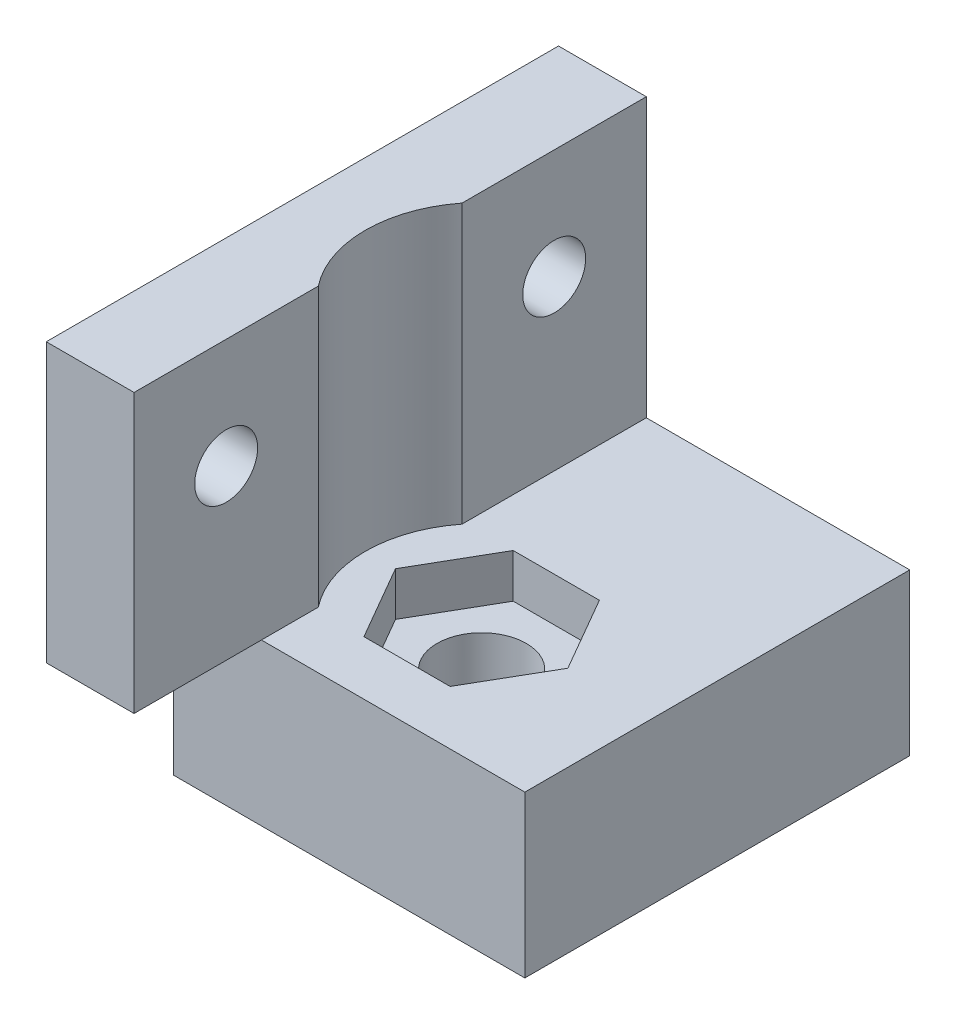
ISO-10303-21;
HEADER;
FILE_DESCRIPTION(('STEP AP214'),'2;1');
FILE_NAME('part.step','',(''),(''),'','','');
FILE_SCHEMA(('AUTOMOTIVE_DESIGN { 1 0 10303 214 1 1 1 1 }'));
ENDSEC;
DATA;
#1=APPLICATION_CONTEXT('core data for automotive mechanical design processes');
#2=APPLICATION_PROTOCOL_DEFINITION('international standard','automotive_design',2000,#1);
#3=PRODUCT_CONTEXT('',#1,'mechanical');
#4=PRODUCT('Part','Part','',(#3));
#5=PRODUCT_RELATED_PRODUCT_CATEGORY('part','',(#4));
#6=PRODUCT_DEFINITION_FORMATION('','',#4);
#7=PRODUCT_DEFINITION_CONTEXT('part definition',#1,'design');
#8=PRODUCT_DEFINITION('design','',#6,#7);
#9=PRODUCT_DEFINITION_SHAPE('','',#8);
#10=(LENGTH_UNIT() NAMED_UNIT(*) SI_UNIT(.MILLI.,.METRE.));
#11=(NAMED_UNIT(*) PLANE_ANGLE_UNIT() SI_UNIT($,.RADIAN.));
#12=(NAMED_UNIT(*) SI_UNIT($,.STERADIAN.) SOLID_ANGLE_UNIT());
#13=UNCERTAINTY_MEASURE_WITH_UNIT(LENGTH_MEASURE(1.E-05),#10,'distance_accuracy_value','');
#14=(GEOMETRIC_REPRESENTATION_CONTEXT(3) GLOBAL_UNCERTAINTY_ASSIGNED_CONTEXT((#13)) GLOBAL_UNIT_ASSIGNED_CONTEXT((#10,
#11,#12)) REPRESENTATION_CONTEXT('',''));
#15=CARTESIAN_POINT('',(0.,0.,0.));
#16=DIRECTION('',(0.,0.,1.));
#17=DIRECTION('',(1.,0.,0.));
#18=AXIS2_PLACEMENT_3D('',#15,#16,#17);
#19=CARTESIAN_POINT('',(0.,11.,17.5));
#20=DIRECTION('',(0.,0.,-1.));
#21=DIRECTION('',(-1.,0.,0.));
#22=AXIS2_PLACEMENT_3D('',#19,#20,#21);
#23=PLANE('',#22);
#24=DIRECTION('',(-1.,0.,0.));
#25=VECTOR('',#24,1.);
#26=CARTESIAN_POINT('',(-3.,11.,17.5));
#27=LINE('',#26,#25);
#28=CARTESIAN_POINT('',(3.,11.,17.5));
#29=VERTEX_POINT('',#28);
#30=CARTESIAN_POINT('',(-3.,11.,17.5));
#31=VERTEX_POINT('',#30);
#32=EDGE_CURVE('E51',#29,#31,#27,.T.);
#33=ORIENTED_EDGE('',*,*,#32,.F.);
#34=DIRECTION('',(0.,-1.,0.));
#35=VECTOR('',#34,1.);
#36=CARTESIAN_POINT('',(3.,30.,17.5));
#37=LINE('',#36,#35);
#38=CARTESIAN_POINT('',(3.,30.,17.5));
#39=VERTEX_POINT('',#38);
#40=EDGE_CURVE('E335',#39,#29,#37,.T.);
#41=ORIENTED_EDGE('',*,*,#40,.F.);
#42=DIRECTION('',(1.,0.,0.));
#43=VECTOR('',#42,1.);
#44=CARTESIAN_POINT('',(0.,30.,17.5));
#45=LINE('',#44,#43);
#46=CARTESIAN_POINT('',(-3.,30.,17.5));
#47=VERTEX_POINT('',#46);
#48=EDGE_CURVE('E332',#47,#39,#45,.T.);
#49=ORIENTED_EDGE('',*,*,#48,.F.);
#50=DIRECTION('',(0.,-1.,0.));
#51=VECTOR('',#50,1.);
#52=CARTESIAN_POINT('',(-3.,30.,17.5));
#53=LINE('',#52,#51);
#54=EDGE_CURVE('E339',#47,#31,#53,.T.);
#55=ORIENTED_EDGE('',*,*,#54,.T.);
#56=EDGE_LOOP('',(#33,#41,#49,#55));
#57=FACE_BOUND('',#56,.T.);
#58=ADVANCED_FACE('F34',(#57),#23,.F.);
#59=CARTESIAN_POINT('',(9.25,11.,0.));
#60=DIRECTION('',(0.,-1.,0.));
#61=DIRECTION('',(0.,0.,-1.));
#62=AXIS2_PLACEMENT_3D('',#59,#60,#61);
#63=CYLINDRICAL_SURFACE('',#62,3.05);
#64=CARTESIAN_POINT('',(9.25,8.,0.));
#65=DIRECTION('',(0.,1.,0.));
#66=DIRECTION('',(0.,0.,1.));
#67=AXIS2_PLACEMENT_3D('',#64,#65,#66);
#68=CIRCLE('',#67,3.05);
#69=CARTESIAN_POINT('',(9.25,8.,3.05));
#70=VERTEX_POINT('',#69);
#71=EDGE_CURVE('E303',#70,#70,#68,.T.);
#72=ORIENTED_EDGE('',*,*,#71,.T.);
#73=EDGE_LOOP('',(#72));
#74=FACE_BOUND('',#73,.T.);
#75=CARTESIAN_POINT('',(9.25,3.,0.));
#76=DIRECTION('',(0.,-1.,0.));
#77=DIRECTION('',(0.,0.,-1.));
#78=AXIS2_PLACEMENT_3D('',#75,#76,#77);
#79=CIRCLE('',#78,3.05);
#80=CARTESIAN_POINT('',(9.25,3.,-3.05));
#81=VERTEX_POINT('',#80);
#82=EDGE_CURVE('E255',#81,#81,#79,.T.);
#83=ORIENTED_EDGE('',*,*,#82,.T.);
#84=EDGE_LOOP('',(#83));
#85=FACE_BOUND('',#84,.T.);
#86=ADVANCED_FACE('F36',(#74,#85),#63,.F.);
#87=CARTESIAN_POINT('',(3.,30.,0.));
#88=DIRECTION('',(1.,0.,0.));
#89=DIRECTION('',(0.,0.,-1.));
#90=AXIS2_PLACEMENT_3D('',#87,#88,#89);
#91=PLANE('',#90);
#92=CARTESIAN_POINT('',(3.,22.5,-11.2060358560204));
#93=DIRECTION('',(1.,0.,0.));
#94=DIRECTION('',(0.,0.,-1.));
#95=AXIS2_PLACEMENT_3D('',#92,#93,#94);
#96=CIRCLE('',#95,2.15);
#97=CARTESIAN_POINT('',(3.,22.5,-13.3560358560204));
#98=VERTEX_POINT('',#97);
#99=EDGE_CURVE('E211',#98,#98,#96,.T.);
#100=ORIENTED_EDGE('',*,*,#99,.F.);
#101=EDGE_LOOP('',(#100));
#102=FACE_BOUND('',#101,.T.);
#103=DIRECTION('',(0.,1.,0.));
#104=VECTOR('',#103,1.);
#105=CARTESIAN_POINT('',(3.,11.,-4.91207171204085));
#106=LINE('',#105,#104);
#107=CARTESIAN_POINT('',(3.,11.,-4.91207171204085));
#108=VERTEX_POINT('',#107);
#109=CARTESIAN_POINT('',(3.,30.,-4.91207171204085));
#110=VERTEX_POINT('',#109);
#111=EDGE_CURVE('E321',#108,#110,#106,.T.);
#112=ORIENTED_EDGE('',*,*,#111,.F.);
#113=DIRECTION('',(0.,0.,1.));
#114=VECTOR('',#113,1.);
#115=CARTESIAN_POINT('',(3.,11.,0.));
#116=LINE('',#115,#114);
#117=CARTESIAN_POINT('',(3.,11.,-17.5));
#118=VERTEX_POINT('',#117);
#119=EDGE_CURVE('E43',#118,#108,#116,.T.);
#120=ORIENTED_EDGE('',*,*,#119,.F.);
#121=DIRECTION('',(0.,-1.,0.));
#122=VECTOR('',#121,1.);
#123=CARTESIAN_POINT('',(3.,30.,-17.5));
#124=LINE('',#123,#122);
#125=CARTESIAN_POINT('',(3.,30.,-17.5));
#126=VERTEX_POINT('',#125);
#127=EDGE_CURVE('E343',#126,#118,#124,.T.);
#128=ORIENTED_EDGE('',*,*,#127,.F.);
#129=DIRECTION('',(0.,0.,1.));
#130=VECTOR('',#129,1.);
#131=CARTESIAN_POINT('',(3.,30.,0.));
#132=LINE('',#131,#130);
#133=EDGE_CURVE('E323',#126,#110,#132,.T.);
#134=ORIENTED_EDGE('',*,*,#133,.T.);
#135=EDGE_LOOP('',(#112,#120,#128,#134));
#136=FACE_BOUND('',#135,.T.);
#137=ADVANCED_FACE('F389',(#102,#136),#91,.T.);
#138=CARTESIAN_POINT('',(21.,11.,0.));
#139=DIRECTION('',(1.,0.,0.));
#140=DIRECTION('',(0.,0.,-1.));
#141=AXIS2_PLACEMENT_3D('',#138,#139,#140);
#142=PLANE('',#141);
#143=DIRECTION('',(0.,-1.,0.));
#144=VECTOR('',#143,1.);
#145=CARTESIAN_POINT('',(21.,11.,8.79941222843731));
#146=LINE('',#145,#144);
#147=CARTESIAN_POINT('',(21.,11.,8.79941222843731));
#148=VERTEX_POINT('',#147);
#149=CARTESIAN_POINT('',(21.,0.,8.79941222843731));
#150=VERTEX_POINT('',#149);
#151=EDGE_CURVE('E202',#148,#150,#146,.T.);
#152=ORIENTED_EDGE('',*,*,#151,.T.);
#153=DIRECTION('',(0.,0.,1.));
#154=VECTOR('',#153,1.);
#155=CARTESIAN_POINT('',(21.,0.,0.));
#156=LINE('',#155,#154);
#157=CARTESIAN_POINT('',(21.,0.,-17.5));
#158=VERTEX_POINT('',#157);
#159=EDGE_CURVE('E346',#158,#150,#156,.T.);
#160=ORIENTED_EDGE('',*,*,#159,.F.);
#161=DIRECTION('',(0.,-1.,0.));
#162=VECTOR('',#161,1.);
#163=CARTESIAN_POINT('',(21.,11.,-17.5));
#164=LINE('',#163,#162);
#165=CARTESIAN_POINT('',(21.,11.,-17.5));
#166=VERTEX_POINT('',#165);
#167=EDGE_CURVE('E11',#166,#158,#164,.T.);
#168=ORIENTED_EDGE('',*,*,#167,.F.);
#169=DIRECTION('',(0.,0.,1.));
#170=VECTOR('',#169,1.);
#171=CARTESIAN_POINT('',(21.,11.,0.));
#172=LINE('',#171,#170);
#173=EDGE_CURVE('E347',#166,#148,#172,.T.);
#174=ORIENTED_EDGE('',*,*,#173,.T.);
#175=EDGE_LOOP('',(#152,#160,#168,#174));
#176=FACE_BOUND('',#175,.T.);
#177=ADVANCED_FACE('F398',(#176),#142,.T.);
#178=CARTESIAN_POINT('',(0.,11.,-17.5));
#179=DIRECTION('',(0.,0.,-1.));
#180=DIRECTION('',(-1.,0.,0.));
#181=AXIS2_PLACEMENT_3D('',#178,#179,#180);
#182=PLANE('',#181);
#183=DIRECTION('',(1.,0.,0.));
#184=VECTOR('',#183,1.);
#185=CARTESIAN_POINT('',(0.,0.,-17.5));
#186=LINE('',#185,#184);
#187=CARTESIAN_POINT('',(-3.,0.,-17.5));
#188=VERTEX_POINT('',#187);
#189=EDGE_CURVE('E351',#188,#158,#186,.T.);
#190=ORIENTED_EDGE('',*,*,#189,.F.);
#191=DIRECTION('',(0.,-1.,0.));
#192=VECTOR('',#191,1.);
#193=CARTESIAN_POINT('',(-3.,30.,-17.5));
#194=LINE('',#193,#192);
#195=CARTESIAN_POINT('',(-3.,30.,-17.5));
#196=VERTEX_POINT('',#195);
#197=EDGE_CURVE('E341',#196,#188,#194,.T.);
#198=ORIENTED_EDGE('',*,*,#197,.F.);
#199=DIRECTION('',(1.,0.,0.));
#200=VECTOR('',#199,1.);
#201=CARTESIAN_POINT('',(0.,30.,-17.5));
#202=LINE('',#201,#200);
#203=EDGE_CURVE('E326',#196,#126,#202,.T.);
#204=ORIENTED_EDGE('',*,*,#203,.T.);
#205=ORIENTED_EDGE('',*,*,#127,.T.);
#206=DIRECTION('',(1.,0.,0.));
#207=VECTOR('',#206,1.);
#208=CARTESIAN_POINT('',(0.,11.,-17.5));
#209=LINE('',#208,#207);
#210=EDGE_CURVE('E350',#118,#166,#209,.T.);
#211=ORIENTED_EDGE('',*,*,#210,.T.);
#212=ORIENTED_EDGE('',*,*,#167,.T.);
#213=EDGE_LOOP('',(#190,#198,#204,#205,#211,#212));
#214=FACE_BOUND('',#213,.T.);
#215=ADVANCED_FACE('F395',(#214),#182,.T.);
#216=CARTESIAN_POINT('',(0.,11.,0.));
#217=DIRECTION('',(0.,1.,0.));
#218=DIRECTION('',(0.,0.,1.));
#219=AXIS2_PLACEMENT_3D('',#216,#217,#218);
#220=PLANE('',#219);
#221=DIRECTION('',(1.,0.,0.));
#222=VECTOR('',#221,1.);
#223=CARTESIAN_POINT('',(-3.,11.,8.79941222843731));
#224=LINE('',#223,#222);
#225=CARTESIAN_POINT('',(3.,11.,8.79941222843731));
#226=VERTEX_POINT('',#225);
#227=EDGE_CURVE('E187',#226,#148,#224,.T.);
#228=ORIENTED_EDGE('',*,*,#227,.T.);
#229=ORIENTED_EDGE('',*,*,#173,.F.);
#230=ORIENTED_EDGE('',*,*,#210,.F.);
#231=ORIENTED_EDGE('',*,*,#119,.T.);
#232=CARTESIAN_POINT('',(9.25,11.,0.));
#233=DIRECTION('',(0.,1.,0.));
#234=DIRECTION('',(0.,0.,1.));
#235=AXIS2_PLACEMENT_3D('',#232,#233,#234);
#236=CIRCLE('',#235,7.94927345763321);
#237=CARTESIAN_POINT('',(3.,11.,4.91207171204083));
#238=VERTEX_POINT('',#237);
#239=EDGE_CURVE('E314',#108,#238,#236,.T.);
#240=ORIENTED_EDGE('',*,*,#239,.T.);
#241=EDGE_CURVE('E354',#238,#226,#116,.T.);
#242=ORIENTED_EDGE('',*,*,#241,.T.);
#243=EDGE_LOOP('',(#228,#229,#230,#231,#240,#242));
#244=FACE_BOUND('',#243,.T.);
#245=DIRECTION('',(0.5,0.,-0.866025403784438));
#246=VECTOR('',#245,1.);
#247=CARTESIAN_POINT('',(12.1944863728671,11.,5.1));
#248=LINE('',#247,#246);
#249=CARTESIAN_POINT('',(12.1944863728671,11.,5.1));
#250=VERTEX_POINT('',#249);
#251=CARTESIAN_POINT('',(15.1389727457342,11.,0.));
#252=VERTEX_POINT('',#251);
#253=EDGE_CURVE('E285',#250,#252,#248,.T.);
#254=ORIENTED_EDGE('',*,*,#253,.F.);
#255=DIRECTION('',(1.,0.,0.));
#256=VECTOR('',#255,1.);
#257=CARTESIAN_POINT('',(6.30551362713291,11.,5.1));
#258=LINE('',#257,#256);
#259=CARTESIAN_POINT('',(6.30551362713291,11.,5.1));
#260=VERTEX_POINT('',#259);
#261=EDGE_CURVE('E269',#260,#250,#258,.T.);
#262=ORIENTED_EDGE('',*,*,#261,.F.);
#263=DIRECTION('',(0.5,0.,0.866025403784439));
#264=VECTOR('',#263,1.);
#265=CARTESIAN_POINT('',(3.36102725426582,11.,0.));
#266=LINE('',#265,#264);
#267=CARTESIAN_POINT('',(3.36102725426582,11.,0.));
#268=VERTEX_POINT('',#267);
#269=EDGE_CURVE('E296',#268,#260,#266,.T.);
#270=ORIENTED_EDGE('',*,*,#269,.F.);
#271=DIRECTION('',(-0.5,0.,0.866025403784439));
#272=VECTOR('',#271,1.);
#273=CARTESIAN_POINT('',(6.30551362713291,11.,-5.1));
#274=LINE('',#273,#272);
#275=CARTESIAN_POINT('',(6.30551362713291,11.,-5.1));
#276=VERTEX_POINT('',#275);
#277=EDGE_CURVE('E293',#276,#268,#274,.T.);
#278=ORIENTED_EDGE('',*,*,#277,.F.);
#279=DIRECTION('',(-1.,0.,0.));
#280=VECTOR('',#279,1.);
#281=CARTESIAN_POINT('',(12.1944863728671,11.,-5.1));
#282=LINE('',#281,#280);
#283=CARTESIAN_POINT('',(12.1944863728671,11.,-5.1));
#284=VERTEX_POINT('',#283);
#285=EDGE_CURVE('E290',#284,#276,#282,.T.);
#286=ORIENTED_EDGE('',*,*,#285,.F.);
#287=DIRECTION('',(-0.5,0.,-0.866025403784439));
#288=VECTOR('',#287,1.);
#289=CARTESIAN_POINT('',(15.1389727457342,11.,0.));
#290=LINE('',#289,#288);
#291=EDGE_CURVE('E287',#252,#284,#290,.T.);
#292=ORIENTED_EDGE('',*,*,#291,.F.);
#293=EDGE_LOOP('',(#254,#262,#270,#278,#286,#292));
#294=FACE_BOUND('',#293,.T.);
#295=ADVANCED_FACE('F397',(#244,#294),#220,.T.);
#296=CARTESIAN_POINT('',(0.,0.,0.));
#297=DIRECTION('',(0.,1.,0.));
#298=DIRECTION('',(0.,0.,1.));
#299=AXIS2_PLACEMENT_3D('',#296,#297,#298);
#300=PLANE('',#299);
#301=DIRECTION('',(0.5,0.,-0.866025403784439));
#302=VECTOR('',#301,1.);
#303=CARTESIAN_POINT('',(3.36102725426582,0.,0.));
#304=LINE('',#303,#302);
#305=CARTESIAN_POINT('',(3.36102725426582,0.,0.));
#306=VERTEX_POINT('',#305);
#307=CARTESIAN_POINT('',(6.30551362713291,0.,-5.1));
#308=VERTEX_POINT('',#307);
#309=EDGE_CURVE('E239',#306,#308,#304,.T.);
#310=ORIENTED_EDGE('',*,*,#309,.F.);
#311=DIRECTION('',(-0.5,0.,-0.866025403784439));
#312=VECTOR('',#311,1.);
#313=CARTESIAN_POINT('',(6.30551362713291,0.,5.1));
#314=LINE('',#313,#312);
#315=CARTESIAN_POINT('',(6.30551362713291,0.,5.1));
#316=VERTEX_POINT('',#315);
#317=EDGE_CURVE('E59',#316,#306,#314,.T.);
#318=ORIENTED_EDGE('',*,*,#317,.F.);
#319=DIRECTION('',(-1.,0.,0.));
#320=VECTOR('',#319,1.);
#321=CARTESIAN_POINT('',(12.1944863728671,0.,5.1));
#322=LINE('',#321,#320);
#323=CARTESIAN_POINT('',(12.1944863728671,0.,5.1));
#324=VERTEX_POINT('',#323);
#325=EDGE_CURVE('E222',#324,#316,#322,.T.);
#326=ORIENTED_EDGE('',*,*,#325,.F.);
#327=DIRECTION('',(-0.5,0.,0.866025403784439));
#328=VECTOR('',#327,1.);
#329=CARTESIAN_POINT('',(15.1389727457342,0.,0.));
#330=LINE('',#329,#328);
#331=CARTESIAN_POINT('',(15.1389727457342,0.,0.));
#332=VERTEX_POINT('',#331);
#333=EDGE_CURVE('E248',#332,#324,#330,.T.);
#334=ORIENTED_EDGE('',*,*,#333,.F.);
#335=DIRECTION('',(0.5,0.,0.866025403784439));
#336=VECTOR('',#335,1.);
#337=CARTESIAN_POINT('',(12.1944863728671,0.,-5.1));
#338=LINE('',#337,#336);
#339=CARTESIAN_POINT('',(12.1944863728671,0.,-5.1));
#340=VERTEX_POINT('',#339);
#341=EDGE_CURVE('E245',#340,#332,#338,.T.);
#342=ORIENTED_EDGE('',*,*,#341,.F.);
#343=DIRECTION('',(1.,0.,0.));
#344=VECTOR('',#343,1.);
#345=CARTESIAN_POINT('',(6.30551362713291,0.,-5.1));
#346=LINE('',#345,#344);
#347=EDGE_CURVE('E242',#308,#340,#346,.T.);
#348=ORIENTED_EDGE('',*,*,#347,.F.);
#349=EDGE_LOOP('',(#310,#318,#326,#334,#342,#348));
#350=FACE_BOUND('',#349,.T.);
#351=ORIENTED_EDGE('',*,*,#159,.T.);
#352=DIRECTION('',(1.,0.,0.));
#353=VECTOR('',#352,1.);
#354=CARTESIAN_POINT('',(-3.,0.,8.79941222843731));
#355=LINE('',#354,#353);
#356=CARTESIAN_POINT('',(-3.,0.,8.79941222843731));
#357=VERTEX_POINT('',#356);
#358=EDGE_CURVE('E195',#357,#150,#355,.T.);
#359=ORIENTED_EDGE('',*,*,#358,.F.);
#360=DIRECTION('',(0.,0.,1.));
#361=VECTOR('',#360,1.);
#362=CARTESIAN_POINT('',(-3.,0.,0.));
#363=LINE('',#362,#361);
#364=EDGE_CURVE('E201',#188,#357,#363,.T.);
#365=ORIENTED_EDGE('',*,*,#364,.F.);
#366=ORIENTED_EDGE('',*,*,#189,.T.);
#367=EDGE_LOOP('',(#351,#359,#365,#366));
#368=FACE_BOUND('',#367,.T.);
#369=ADVANCED_FACE('F393',(#350,#368),#300,.F.);
#370=CARTESIAN_POINT('',(3.,22.5,11.2060358560204));
#371=DIRECTION('',(1.,0.,0.));
#372=DIRECTION('',(0.,0.,-1.));
#373=AXIS2_PLACEMENT_3D('',#370,#371,#372);
#374=CIRCLE('',#373,2.15);
#375=CARTESIAN_POINT('',(3.,22.5,9.05603585602042));
#376=VERTEX_POINT('',#375);
#377=EDGE_CURVE('E214',#376,#376,#374,.T.);
#378=ORIENTED_EDGE('',*,*,#377,.F.);
#379=EDGE_LOOP('',(#378));
#380=FACE_BOUND('',#379,.T.);
#381=DIRECTION('',(0.,1.,0.));
#382=VECTOR('',#381,1.);
#383=CARTESIAN_POINT('',(3.,11.,4.91207171204083));
#384=LINE('',#383,#382);
#385=CARTESIAN_POINT('',(3.,30.,4.91207171204083));
#386=VERTEX_POINT('',#385);
#387=EDGE_CURVE('E317',#386,#238,#384,.F.);
#388=ORIENTED_EDGE('',*,*,#387,.F.);
#389=EDGE_CURVE('E327',#386,#39,#132,.T.);
#390=ORIENTED_EDGE('',*,*,#389,.T.);
#391=ORIENTED_EDGE('',*,*,#40,.T.);
#392=DIRECTION('',(0.,0.,-1.));
#393=VECTOR('',#392,1.);
#394=CARTESIAN_POINT('',(3.,11.,0.));
#395=LINE('',#394,#393);
#396=EDGE_CURVE('E205',#29,#226,#395,.T.);
#397=ORIENTED_EDGE('',*,*,#396,.T.);
#398=ORIENTED_EDGE('',*,*,#241,.F.);
#399=EDGE_LOOP('',(#388,#390,#391,#397,#398));
#400=FACE_BOUND('',#399,.T.);
#401=ADVANCED_FACE('F407',(#380,#400),#91,.T.);
#402=CARTESIAN_POINT('',(-3.,30.,0.));
#403=DIRECTION('',(1.,0.,0.));
#404=DIRECTION('',(0.,0.,-1.));
#405=AXIS2_PLACEMENT_3D('',#402,#403,#404);
#406=PLANE('',#405);
#407=CARTESIAN_POINT('',(-3.,22.5,-11.2060358560204));
#408=DIRECTION('',(1.,0.,0.));
#409=DIRECTION('',(0.,0.,-1.));
#410=AXIS2_PLACEMENT_3D('',#407,#408,#409);
#411=CIRCLE('',#410,2.15);
#412=CARTESIAN_POINT('',(-3.,22.5,-13.3560358560204));
#413=VERTEX_POINT('',#412);
#414=EDGE_CURVE('E38',#413,#413,#411,.T.);
#415=ORIENTED_EDGE('',*,*,#414,.T.);
#416=EDGE_LOOP('',(#415));
#417=FACE_BOUND('',#416,.T.);
#418=CARTESIAN_POINT('',(-3.,22.5,11.2060358560204));
#419=DIRECTION('',(1.,0.,0.));
#420=DIRECTION('',(0.,0.,-1.));
#421=AXIS2_PLACEMENT_3D('',#418,#419,#420);
#422=CIRCLE('',#421,2.15);
#423=CARTESIAN_POINT('',(-3.,22.5,9.05603585602042));
#424=VERTEX_POINT('',#423);
#425=EDGE_CURVE('E217',#424,#424,#422,.T.);
#426=ORIENTED_EDGE('',*,*,#425,.T.);
#427=EDGE_LOOP('',(#426));
#428=FACE_BOUND('',#427,.T.);
#429=ORIENTED_EDGE('',*,*,#364,.T.);
#430=DIRECTION('',(0.,-1.,0.));
#431=VECTOR('',#430,1.);
#432=CARTESIAN_POINT('',(-3.,11.,8.79941222843731));
#433=LINE('',#432,#431);
#434=CARTESIAN_POINT('',(-3.,11.,8.79941222843731));
#435=VERTEX_POINT('',#434);
#436=EDGE_CURVE('E184',#435,#357,#433,.T.);
#437=ORIENTED_EDGE('',*,*,#436,.F.);
#438=DIRECTION('',(0.,0.,-1.));
#439=VECTOR('',#438,1.);
#440=CARTESIAN_POINT('',(-3.,11.,17.5));
#441=LINE('',#440,#439);
#442=EDGE_CURVE('E190',#31,#435,#441,.T.);
#443=ORIENTED_EDGE('',*,*,#442,.F.);
#444=ORIENTED_EDGE('',*,*,#54,.F.);
#445=DIRECTION('',(0.,0.,1.));
#446=VECTOR('',#445,1.);
#447=CARTESIAN_POINT('',(-3.,30.,0.));
#448=LINE('',#447,#446);
#449=EDGE_CURVE('E330',#196,#47,#448,.T.);
#450=ORIENTED_EDGE('',*,*,#449,.F.);
#451=ORIENTED_EDGE('',*,*,#197,.T.);
#452=EDGE_LOOP('',(#429,#437,#443,#444,#450,#451));
#453=FACE_BOUND('',#452,.T.);
#454=ADVANCED_FACE('F198',(#417,#428,#453),#406,.F.);
#455=CARTESIAN_POINT('',(0.,30.,0.));
#456=DIRECTION('',(0.,1.,0.));
#457=DIRECTION('',(0.,0.,1.));
#458=AXIS2_PLACEMENT_3D('',#455,#456,#457);
#459=PLANE('',#458);
#460=CARTESIAN_POINT('',(9.25,30.,0.));
#461=DIRECTION('',(0.,1.,0.));
#462=DIRECTION('',(0.,0.,1.));
#463=AXIS2_PLACEMENT_3D('',#460,#461,#462);
#464=CIRCLE('',#463,7.94927345763321);
#465=EDGE_CURVE('E318',#110,#386,#464,.T.);
#466=ORIENTED_EDGE('',*,*,#465,.F.);
#467=ORIENTED_EDGE('',*,*,#133,.F.);
#468=ORIENTED_EDGE('',*,*,#203,.F.);
#469=ORIENTED_EDGE('',*,*,#449,.T.);
#470=ORIENTED_EDGE('',*,*,#48,.T.);
#471=ORIENTED_EDGE('',*,*,#389,.F.);
#472=EDGE_LOOP('',(#466,#467,#468,#469,#470,#471));
#473=FACE_BOUND('',#472,.T.);
#474=ADVANCED_FACE('F417',(#473),#459,.T.);
#475=CARTESIAN_POINT('',(9.25,11.,0.));
#476=DIRECTION('',(0.,1.,0.));
#477=DIRECTION('',(0.,0.,1.));
#478=AXIS2_PLACEMENT_3D('',#475,#476,#477);
#479=CYLINDRICAL_SURFACE('',#478,7.94927345763321);
#480=ORIENTED_EDGE('',*,*,#111,.T.);
#481=ORIENTED_EDGE('',*,*,#465,.T.);
#482=ORIENTED_EDGE('',*,*,#387,.T.);
#483=ORIENTED_EDGE('',*,*,#239,.F.);
#484=EDGE_LOOP('',(#480,#481,#482,#483));
#485=FACE_BOUND('',#484,.T.);
#486=ADVANCED_FACE('F430',(#485),#479,.F.);
#487=CARTESIAN_POINT('',(12.1944863728671,8.,5.1));
#488=DIRECTION('',(0.866025403784439,0.,0.5));
#489=DIRECTION('',(0.5,0.,-0.866025403784439));
#490=AXIS2_PLACEMENT_3D('',#487,#488,#489);
#491=PLANE('',#490);
#492=ORIENTED_EDGE('',*,*,#253,.T.);
#493=DIRECTION('',(0.,1.,0.));
#494=VECTOR('',#493,1.);
#495=CARTESIAN_POINT('',(15.1389727457342,8.,0.));
#496=LINE('',#495,#494);
#497=CARTESIAN_POINT('',(15.1389727457342,8.,0.));
#498=VERTEX_POINT('',#497);
#499=EDGE_CURVE('E284',#498,#252,#496,.T.);
#500=ORIENTED_EDGE('',*,*,#499,.F.);
#501=DIRECTION('',(0.5,0.,-0.866025403784438));
#502=VECTOR('',#501,1.);
#503=CARTESIAN_POINT('',(12.1944863728671,8.,5.1));
#504=LINE('',#503,#502);
#505=CARTESIAN_POINT('',(12.1944863728671,8.,5.1));
#506=VERTEX_POINT('',#505);
#507=EDGE_CURVE('E265',#506,#498,#504,.T.);
#508=ORIENTED_EDGE('',*,*,#507,.F.);
#509=DIRECTION('',(0.,1.,0.));
#510=VECTOR('',#509,1.);
#511=CARTESIAN_POINT('',(12.1944863728671,8.,5.1));
#512=LINE('',#511,#510);
#513=EDGE_CURVE('E301',#506,#250,#512,.T.);
#514=ORIENTED_EDGE('',*,*,#513,.T.);
#515=EDGE_LOOP('',(#492,#500,#508,#514));
#516=FACE_BOUND('',#515,.T.);
#517=ADVANCED_FACE('F432',(#516),#491,.F.);
#518=CARTESIAN_POINT('',(6.30551362713291,8.,5.1));
#519=DIRECTION('',(0.,0.,1.));
#520=DIRECTION('',(1.,0.,0.));
#521=AXIS2_PLACEMENT_3D('',#518,#519,#520);
#522=PLANE('',#521);
#523=ORIENTED_EDGE('',*,*,#261,.T.);
#524=ORIENTED_EDGE('',*,*,#513,.F.);
#525=DIRECTION('',(1.,0.,0.));
#526=VECTOR('',#525,1.);
#527=CARTESIAN_POINT('',(6.30551362713291,8.,5.1));
#528=LINE('',#527,#526);
#529=CARTESIAN_POINT('',(6.30551362713291,8.,5.1));
#530=VERTEX_POINT('',#529);
#531=EDGE_CURVE('E281',#530,#506,#528,.T.);
#532=ORIENTED_EDGE('',*,*,#531,.F.);
#533=DIRECTION('',(0.,1.,0.));
#534=VECTOR('',#533,1.);
#535=CARTESIAN_POINT('',(6.30551362713291,8.,5.1));
#536=LINE('',#535,#534);
#537=EDGE_CURVE('E304',#530,#260,#536,.T.);
#538=ORIENTED_EDGE('',*,*,#537,.T.);
#539=EDGE_LOOP('',(#523,#524,#532,#538));
#540=FACE_BOUND('',#539,.T.);
#541=ADVANCED_FACE('F438',(#540),#522,.F.);
#542=CARTESIAN_POINT('',(3.36102725426582,8.,0.));
#543=DIRECTION('',(-0.866025403784439,0.,0.5));
#544=DIRECTION('',(0.5,0.,0.866025403784439));
#545=AXIS2_PLACEMENT_3D('',#542,#543,#544);
#546=PLANE('',#545);
#547=ORIENTED_EDGE('',*,*,#269,.T.);
#548=ORIENTED_EDGE('',*,*,#537,.F.);
#549=DIRECTION('',(0.5,0.,0.866025403784439));
#550=VECTOR('',#549,1.);
#551=CARTESIAN_POINT('',(3.36102725426582,8.,0.));
#552=LINE('',#551,#550);
#553=CARTESIAN_POINT('',(3.36102725426582,8.,0.));
#554=VERTEX_POINT('',#553);
#555=EDGE_CURVE('E278',#554,#530,#552,.T.);
#556=ORIENTED_EDGE('',*,*,#555,.F.);
#557=DIRECTION('',(0.,1.,0.));
#558=VECTOR('',#557,1.);
#559=CARTESIAN_POINT('',(3.36102725426582,8.,0.));
#560=LINE('',#559,#558);
#561=EDGE_CURVE('E306',#554,#268,#560,.T.);
#562=ORIENTED_EDGE('',*,*,#561,.T.);
#563=EDGE_LOOP('',(#547,#548,#556,#562));
#564=FACE_BOUND('',#563,.T.);
#565=ADVANCED_FACE('F496',(#564),#546,.F.);
#566=CARTESIAN_POINT('',(6.30551362713291,8.,-5.1));
#567=DIRECTION('',(-0.866025403784438,0.,-0.5));
#568=DIRECTION('',(-0.5,0.,0.866025403784439));
#569=AXIS2_PLACEMENT_3D('',#566,#567,#568);
#570=PLANE('',#569);
#571=ORIENTED_EDGE('',*,*,#277,.T.);
#572=ORIENTED_EDGE('',*,*,#561,.F.);
#573=DIRECTION('',(-0.5,0.,0.866025403784439));
#574=VECTOR('',#573,1.);
#575=CARTESIAN_POINT('',(6.30551362713291,8.,-5.1));
#576=LINE('',#575,#574);
#577=CARTESIAN_POINT('',(6.30551362713291,8.,-5.1));
#578=VERTEX_POINT('',#577);
#579=EDGE_CURVE('E275',#578,#554,#576,.T.);
#580=ORIENTED_EDGE('',*,*,#579,.F.);
#581=DIRECTION('',(0.,1.,0.));
#582=VECTOR('',#581,1.);
#583=CARTESIAN_POINT('',(6.30551362713291,8.,-5.1));
#584=LINE('',#583,#582);
#585=EDGE_CURVE('E308',#578,#276,#584,.T.);
#586=ORIENTED_EDGE('',*,*,#585,.T.);
#587=EDGE_LOOP('',(#571,#572,#580,#586));
#588=FACE_BOUND('',#587,.T.);
#589=ADVANCED_FACE('F500',(#588),#570,.F.);
#590=CARTESIAN_POINT('',(12.1944863728671,8.,-5.1));
#591=DIRECTION('',(0.,0.,-1.));
#592=DIRECTION('',(-1.,0.,0.));
#593=AXIS2_PLACEMENT_3D('',#590,#591,#592);
#594=PLANE('',#593);
#595=ORIENTED_EDGE('',*,*,#285,.T.);
#596=ORIENTED_EDGE('',*,*,#585,.F.);
#597=DIRECTION('',(-1.,0.,0.));
#598=VECTOR('',#597,1.);
#599=CARTESIAN_POINT('',(12.1944863728671,8.,-5.1));
#600=LINE('',#599,#598);
#601=CARTESIAN_POINT('',(12.1944863728671,8.,-5.1));
#602=VERTEX_POINT('',#601);
#603=EDGE_CURVE('E272',#602,#578,#600,.T.);
#604=ORIENTED_EDGE('',*,*,#603,.F.);
#605=DIRECTION('',(0.,1.,0.));
#606=VECTOR('',#605,1.);
#607=CARTESIAN_POINT('',(12.1944863728671,8.,-5.1));
#608=LINE('',#607,#606);
#609=EDGE_CURVE('E310',#602,#284,#608,.T.);
#610=ORIENTED_EDGE('',*,*,#609,.T.);
#611=EDGE_LOOP('',(#595,#596,#604,#610));
#612=FACE_BOUND('',#611,.T.);
#613=ADVANCED_FACE('F504',(#612),#594,.F.);
#614=CARTESIAN_POINT('',(15.1389727457342,8.,0.));
#615=DIRECTION('',(0.866025403784439,0.,-0.5));
#616=DIRECTION('',(-0.5,0.,-0.866025403784439));
#617=AXIS2_PLACEMENT_3D('',#614,#615,#616);
#618=PLANE('',#617);
#619=ORIENTED_EDGE('',*,*,#291,.T.);
#620=ORIENTED_EDGE('',*,*,#609,.F.);
#621=DIRECTION('',(-0.5,0.,-0.866025403784439));
#622=VECTOR('',#621,1.);
#623=CARTESIAN_POINT('',(15.1389727457342,8.,0.));
#624=LINE('',#623,#622);
#625=EDGE_CURVE('E268',#498,#602,#624,.T.);
#626=ORIENTED_EDGE('',*,*,#625,.F.);
#627=ORIENTED_EDGE('',*,*,#499,.T.);
#628=EDGE_LOOP('',(#619,#620,#626,#627));
#629=FACE_BOUND('',#628,.T.);
#630=ADVANCED_FACE('F492',(#629),#618,.F.);
#631=CARTESIAN_POINT('',(0.,8.,0.));
#632=DIRECTION('',(0.,1.,0.));
#633=DIRECTION('',(0.,0.,1.));
#634=AXIS2_PLACEMENT_3D('',#631,#632,#633);
#635=PLANE('',#634);
#636=ORIENTED_EDGE('',*,*,#71,.F.);
#637=EDGE_LOOP('',(#636));
#638=FACE_BOUND('',#637,.T.);
#639=ORIENTED_EDGE('',*,*,#507,.T.);
#640=ORIENTED_EDGE('',*,*,#625,.T.);
#641=ORIENTED_EDGE('',*,*,#603,.T.);
#642=ORIENTED_EDGE('',*,*,#579,.T.);
#643=ORIENTED_EDGE('',*,*,#555,.T.);
#644=ORIENTED_EDGE('',*,*,#531,.T.);
#645=EDGE_LOOP('',(#639,#640,#641,#642,#643,#644));
#646=FACE_BOUND('',#645,.T.);
#647=ADVANCED_FACE('F489',(#638,#646),#635,.T.);
#648=CARTESIAN_POINT('',(6.30551362713291,3.,5.1));
#649=DIRECTION('',(-0.866025403784438,0.,0.5));
#650=DIRECTION('',(0.5,0.,0.866025403784439));
#651=AXIS2_PLACEMENT_3D('',#648,#649,#650);
#652=PLANE('',#651);
#653=ORIENTED_EDGE('',*,*,#317,.T.);
#654=DIRECTION('',(0.,-1.,0.));
#655=VECTOR('',#654,1.);
#656=CARTESIAN_POINT('',(3.36102725426582,3.,0.));
#657=LINE('',#656,#655);
#658=CARTESIAN_POINT('',(3.36102725426582,3.,0.));
#659=VERTEX_POINT('',#658);
#660=EDGE_CURVE('E237',#659,#306,#657,.T.);
#661=ORIENTED_EDGE('',*,*,#660,.F.);
#662=DIRECTION('',(-0.5,0.,-0.866025403784439));
#663=VECTOR('',#662,1.);
#664=CARTESIAN_POINT('',(6.30551362713291,3.,5.1));
#665=LINE('',#664,#663);
#666=CARTESIAN_POINT('',(6.30551362713291,3.,5.1));
#667=VERTEX_POINT('',#666);
#668=EDGE_CURVE('E218',#667,#659,#665,.T.);
#669=ORIENTED_EDGE('',*,*,#668,.F.);
#670=DIRECTION('',(0.,-1.,0.));
#671=VECTOR('',#670,1.);
#672=CARTESIAN_POINT('',(6.30551362713291,3.,5.1));
#673=LINE('',#672,#671);
#674=EDGE_CURVE('E253',#667,#316,#673,.T.);
#675=ORIENTED_EDGE('',*,*,#674,.T.);
#676=EDGE_LOOP('',(#653,#661,#669,#675));
#677=FACE_BOUND('',#676,.T.);
#678=ADVANCED_FACE('F463',(#677),#652,.F.);
#679=CARTESIAN_POINT('',(12.1944863728671,3.,5.1));
#680=DIRECTION('',(0.,0.,1.));
#681=DIRECTION('',(1.,0.,0.));
#682=AXIS2_PLACEMENT_3D('',#679,#680,#681);
#683=PLANE('',#682);
#684=ORIENTED_EDGE('',*,*,#325,.T.);
#685=ORIENTED_EDGE('',*,*,#674,.F.);
#686=DIRECTION('',(-1.,0.,0.));
#687=VECTOR('',#686,1.);
#688=CARTESIAN_POINT('',(12.1944863728671,3.,5.1));
#689=LINE('',#688,#687);
#690=CARTESIAN_POINT('',(12.1944863728671,3.,5.1));
#691=VERTEX_POINT('',#690);
#692=EDGE_CURVE('E234',#691,#667,#689,.T.);
#693=ORIENTED_EDGE('',*,*,#692,.F.);
#694=DIRECTION('',(0.,-1.,0.));
#695=VECTOR('',#694,1.);
#696=CARTESIAN_POINT('',(12.1944863728671,3.,5.1));
#697=LINE('',#696,#695);
#698=EDGE_CURVE('E256',#691,#324,#697,.T.);
#699=ORIENTED_EDGE('',*,*,#698,.T.);
#700=EDGE_LOOP('',(#684,#685,#693,#699));
#701=FACE_BOUND('',#700,.T.);
#702=ADVANCED_FACE('F468',(#701),#683,.F.);
#703=CARTESIAN_POINT('',(15.1389727457342,3.,0.));
#704=DIRECTION('',(0.866025403784439,0.,0.5));
#705=DIRECTION('',(0.5,0.,-0.866025403784439));
#706=AXIS2_PLACEMENT_3D('',#703,#704,#705);
#707=PLANE('',#706);
#708=ORIENTED_EDGE('',*,*,#333,.T.);
#709=ORIENTED_EDGE('',*,*,#698,.F.);
#710=DIRECTION('',(-0.5,0.,0.866025403784439));
#711=VECTOR('',#710,1.);
#712=CARTESIAN_POINT('',(15.1389727457342,3.,0.));
#713=LINE('',#712,#711);
#714=CARTESIAN_POINT('',(15.1389727457342,3.,0.));
#715=VERTEX_POINT('',#714);
#716=EDGE_CURVE('E231',#715,#691,#713,.T.);
#717=ORIENTED_EDGE('',*,*,#716,.F.);
#718=DIRECTION('',(0.,-1.,0.));
#719=VECTOR('',#718,1.);
#720=CARTESIAN_POINT('',(15.1389727457342,3.,0.));
#721=LINE('',#720,#719);
#722=EDGE_CURVE('E258',#715,#332,#721,.T.);
#723=ORIENTED_EDGE('',*,*,#722,.T.);
#724=EDGE_LOOP('',(#708,#709,#717,#723));
#725=FACE_BOUND('',#724,.T.);
#726=ADVANCED_FACE('F471',(#725),#707,.F.);
#727=CARTESIAN_POINT('',(12.1944863728671,3.,-5.1));
#728=DIRECTION('',(0.866025403784439,0.,-0.5));
#729=DIRECTION('',(-0.5,0.,-0.866025403784439));
#730=AXIS2_PLACEMENT_3D('',#727,#728,#729);
#731=PLANE('',#730);
#732=ORIENTED_EDGE('',*,*,#341,.T.);
#733=ORIENTED_EDGE('',*,*,#722,.F.);
#734=DIRECTION('',(0.5,0.,0.866025403784439));
#735=VECTOR('',#734,1.);
#736=CARTESIAN_POINT('',(12.1944863728671,3.,-5.1));
#737=LINE('',#736,#735);
#738=CARTESIAN_POINT('',(12.1944863728671,3.,-5.1));
#739=VERTEX_POINT('',#738);
#740=EDGE_CURVE('E228',#739,#715,#737,.T.);
#741=ORIENTED_EDGE('',*,*,#740,.F.);
#742=DIRECTION('',(0.,-1.,0.));
#743=VECTOR('',#742,1.);
#744=CARTESIAN_POINT('',(12.1944863728671,3.,-5.1));
#745=LINE('',#744,#743);
#746=EDGE_CURVE('E260',#739,#340,#745,.T.);
#747=ORIENTED_EDGE('',*,*,#746,.T.);
#748=EDGE_LOOP('',(#732,#733,#741,#747));
#749=FACE_BOUND('',#748,.T.);
#750=ADVANCED_FACE('F474',(#749),#731,.F.);
#751=CARTESIAN_POINT('',(6.30551362713291,3.,-5.1));
#752=DIRECTION('',(0.,0.,-1.));
#753=DIRECTION('',(-1.,0.,0.));
#754=AXIS2_PLACEMENT_3D('',#751,#752,#753);
#755=PLANE('',#754);
#756=ORIENTED_EDGE('',*,*,#347,.T.);
#757=ORIENTED_EDGE('',*,*,#746,.F.);
#758=DIRECTION('',(1.,0.,0.));
#759=VECTOR('',#758,1.);
#760=CARTESIAN_POINT('',(6.30551362713291,3.,-5.1));
#761=LINE('',#760,#759);
#762=CARTESIAN_POINT('',(6.30551362713291,3.,-5.1));
#763=VERTEX_POINT('',#762);
#764=EDGE_CURVE('E225',#763,#739,#761,.T.);
#765=ORIENTED_EDGE('',*,*,#764,.F.);
#766=DIRECTION('',(0.,-1.,0.));
#767=VECTOR('',#766,1.);
#768=CARTESIAN_POINT('',(6.30551362713291,3.,-5.1));
#769=LINE('',#768,#767);
#770=EDGE_CURVE('E262',#763,#308,#769,.T.);
#771=ORIENTED_EDGE('',*,*,#770,.T.);
#772=EDGE_LOOP('',(#756,#757,#765,#771));
#773=FACE_BOUND('',#772,.T.);
#774=ADVANCED_FACE('F476',(#773),#755,.F.);
#775=CARTESIAN_POINT('',(3.36102725426582,3.,0.));
#776=DIRECTION('',(-0.866025403784439,0.,-0.5));
#777=DIRECTION('',(-0.5,0.,0.866025403784439));
#778=AXIS2_PLACEMENT_3D('',#775,#776,#777);
#779=PLANE('',#778);
#780=ORIENTED_EDGE('',*,*,#309,.T.);
#781=ORIENTED_EDGE('',*,*,#770,.F.);
#782=DIRECTION('',(0.5,0.,-0.866025403784439));
#783=VECTOR('',#782,1.);
#784=CARTESIAN_POINT('',(3.36102725426582,3.,0.));
#785=LINE('',#784,#783);
#786=EDGE_CURVE('E221',#659,#763,#785,.T.);
#787=ORIENTED_EDGE('',*,*,#786,.F.);
#788=ORIENTED_EDGE('',*,*,#660,.T.);
#789=EDGE_LOOP('',(#780,#781,#787,#788));
#790=FACE_BOUND('',#789,.T.);
#791=ADVANCED_FACE('F380',(#790),#779,.F.);
#792=CARTESIAN_POINT('',(0.,3.,0.));
#793=DIRECTION('',(0.,-1.,0.));
#794=DIRECTION('',(0.,0.,-1.));
#795=AXIS2_PLACEMENT_3D('',#792,#793,#794);
#796=PLANE('',#795);
#797=ORIENTED_EDGE('',*,*,#82,.F.);
#798=EDGE_LOOP('',(#797));
#799=FACE_BOUND('',#798,.T.);
#800=ORIENTED_EDGE('',*,*,#668,.T.);
#801=ORIENTED_EDGE('',*,*,#786,.T.);
#802=ORIENTED_EDGE('',*,*,#764,.T.);
#803=ORIENTED_EDGE('',*,*,#740,.T.);
#804=ORIENTED_EDGE('',*,*,#716,.T.);
#805=ORIENTED_EDGE('',*,*,#692,.T.);
#806=EDGE_LOOP('',(#800,#801,#802,#803,#804,#805));
#807=FACE_BOUND('',#806,.T.);
#808=ADVANCED_FACE('F371',(#799,#807),#796,.T.);
#809=CARTESIAN_POINT('',(-7.,22.5,11.2060358560204));
#810=DIRECTION('',(1.,0.,0.));
#811=DIRECTION('',(0.,0.,-1.));
#812=AXIS2_PLACEMENT_3D('',#809,#810,#811);
#813=CYLINDRICAL_SURFACE('',#812,2.15);
#814=ORIENTED_EDGE('',*,*,#377,.T.);
#815=EDGE_LOOP('',(#814));
#816=FACE_BOUND('',#815,.T.);
#817=ORIENTED_EDGE('',*,*,#425,.F.);
#818=EDGE_LOOP('',(#817));
#819=FACE_BOUND('',#818,.T.);
#820=ADVANCED_FACE('F368',(#816,#819),#813,.F.);
#821=CARTESIAN_POINT('',(-7.,22.5,-11.2060358560204));
#822=DIRECTION('',(1.,0.,0.));
#823=DIRECTION('',(0.,0.,-1.));
#824=AXIS2_PLACEMENT_3D('',#821,#822,#823);
#825=CYLINDRICAL_SURFACE('',#824,2.15);
#826=ORIENTED_EDGE('',*,*,#99,.T.);
#827=EDGE_LOOP('',(#826));
#828=FACE_BOUND('',#827,.T.);
#829=ORIENTED_EDGE('',*,*,#414,.F.);
#830=EDGE_LOOP('',(#829));
#831=FACE_BOUND('',#830,.T.);
#832=ADVANCED_FACE('F370',(#828,#831),#825,.F.);
#833=CARTESIAN_POINT('',(-3.,11.,8.79941222843731));
#834=DIRECTION('',(0.,0.,-1.));
#835=DIRECTION('',(-1.,0.,0.));
#836=AXIS2_PLACEMENT_3D('',#833,#834,#835);
#837=PLANE('',#836);
#838=ORIENTED_EDGE('',*,*,#358,.T.);
#839=ORIENTED_EDGE('',*,*,#151,.F.);
#840=ORIENTED_EDGE('',*,*,#227,.F.);
#841=EDGE_CURVE('E181',#435,#226,#224,.T.);
#842=ORIENTED_EDGE('',*,*,#841,.F.);
#843=ORIENTED_EDGE('',*,*,#436,.T.);
#844=EDGE_LOOP('',(#838,#839,#840,#842,#843));
#845=FACE_BOUND('',#844,.T.);
#846=ADVANCED_FACE('F182',(#845),#837,.F.);
#847=CARTESIAN_POINT('',(0.,11.,0.));
#848=DIRECTION('',(0.,-1.,0.));
#849=DIRECTION('',(0.,0.,-1.));
#850=AXIS2_PLACEMENT_3D('',#847,#848,#849);
#851=PLANE('',#850);
#852=ORIENTED_EDGE('',*,*,#32,.T.);
#853=ORIENTED_EDGE('',*,*,#442,.T.);
#854=ORIENTED_EDGE('',*,*,#841,.T.);
#855=ORIENTED_EDGE('',*,*,#396,.F.);
#856=EDGE_LOOP('',(#852,#853,#854,#855));
#857=FACE_BOUND('',#856,.T.);
#858=ADVANCED_FACE('F191',(#857),#851,.T.);
#859=CLOSED_SHELL('',(#58,#86,#137,#177,#215,#295,#369,#401,#454,#474,#486,#517,#541,#565,#589,
#613,#630,#647,#678,#702,#726,#750,#774,#791,#808,#820,#832,#846,#858));
#860=MANIFOLD_SOLID_BREP('B2',#859);
#861=ADVANCED_BREP_SHAPE_REPRESENTATION('',(#18,#860),#14);
#862=SHAPE_DEFINITION_REPRESENTATION(#9,#861);
ENDSEC;
END-ISO-10303-21;
